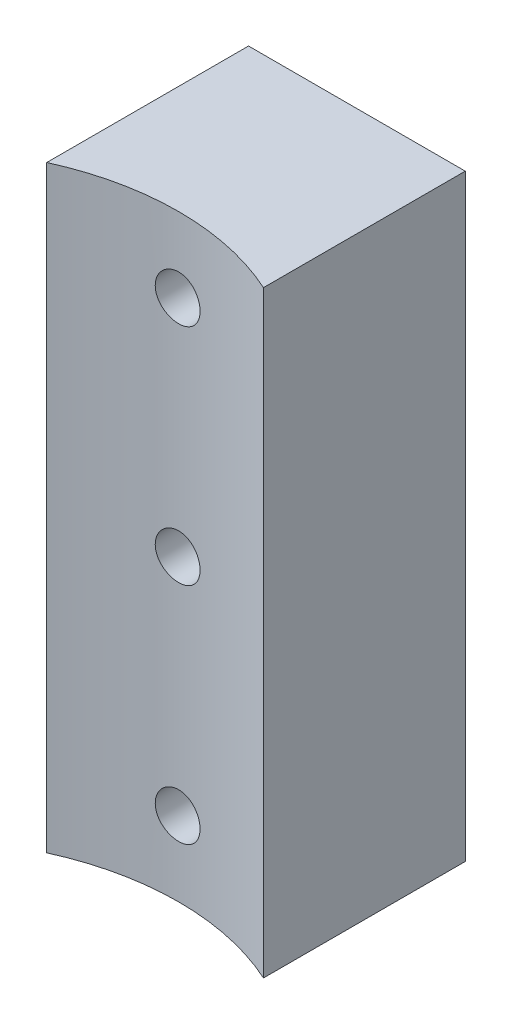
ISO-10303-21;
HEADER;
FILE_DESCRIPTION(('STEP AP214'),'2;1');
FILE_NAME('part.step','',(''),(''),'','','');
FILE_SCHEMA(('AUTOMOTIVE_DESIGN { 1 0 10303 214 1 1 1 1 }'));
ENDSEC;
DATA;
#1=APPLICATION_CONTEXT('core data for automotive mechanical design processes');
#2=APPLICATION_PROTOCOL_DEFINITION('international standard','automotive_design',2000,#1);
#3=PRODUCT_CONTEXT('',#1,'mechanical');
#4=PRODUCT('Part','Part','',(#3));
#5=PRODUCT_RELATED_PRODUCT_CATEGORY('part','',(#4));
#6=PRODUCT_DEFINITION_FORMATION('','',#4);
#7=PRODUCT_DEFINITION_CONTEXT('part definition',#1,'design');
#8=PRODUCT_DEFINITION('design','',#6,#7);
#9=PRODUCT_DEFINITION_SHAPE('','',#8);
#10=(LENGTH_UNIT() NAMED_UNIT(*) SI_UNIT(.MILLI.,.METRE.));
#11=(NAMED_UNIT(*) PLANE_ANGLE_UNIT() SI_UNIT($,.RADIAN.));
#12=(NAMED_UNIT(*) SI_UNIT($,.STERADIAN.) SOLID_ANGLE_UNIT());
#13=UNCERTAINTY_MEASURE_WITH_UNIT(LENGTH_MEASURE(1.E-05),#10,'distance_accuracy_value','');
#14=(GEOMETRIC_REPRESENTATION_CONTEXT(3) GLOBAL_UNCERTAINTY_ASSIGNED_CONTEXT((#13)) GLOBAL_UNIT_ASSIGNED_CONTEXT((#10,
#11,#12)) REPRESENTATION_CONTEXT('',''));
#15=CARTESIAN_POINT('',(0.,0.,0.));
#16=DIRECTION('',(0.,0.,1.));
#17=DIRECTION('',(1.,0.,0.));
#18=AXIS2_PLACEMENT_3D('',#15,#16,#17);
#19=CARTESIAN_POINT('',(0.,80.,45.355140872393));
#20=DIRECTION('',(0.,-1.,0.));
#21=DIRECTION('',(0.,0.,-1.));
#22=AXIS2_PLACEMENT_3D('',#19,#20,#21);
#23=CYLINDRICAL_SURFACE('',#22,35.);
#24=CARTESIAN_POINT('',(-3.,70.,10.4839493240676));
#25=CARTESIAN_POINT('',(-2.99999266095691,70.1681788977969,10.4839476198831));
#26=CARTESIAN_POINT('',(-2.98581034508464,70.3364718555865,10.4827195690312));
#27=CARTESIAN_POINT('',(-2.92944387718635,70.668400071108,10.4779401861653));
#28=CARTESIAN_POINT('',(-2.88722811123404,70.8320298525538,10.4743862312445));
#29=CARTESIAN_POINT('',(-2.77602575299662,71.1497763164806,10.4653605027679));
#30=CARTESIAN_POINT('',(-2.70705447640826,71.3038983830823,10.4598898265767));
#31=CARTESIAN_POINT('',(-2.54432647781201,71.5983417986807,10.4476484327925));
#32=CARTESIAN_POINT('',(-2.45057500494258,71.7386660618111,10.4408779906093));
#33=CARTESIAN_POINT('',(-2.24067380704697,72.0019468210089,10.4267793440726));
#34=CARTESIAN_POINT('',(-2.12447081430969,72.1248607834929,10.4194498388452));
#35=CARTESIAN_POINT('',(-1.87307803845592,72.3494663357357,10.4050708154877));
#36=CARTESIAN_POINT('',(-1.73788742116144,72.4511569926087,10.3980213096763));
#37=CARTESIAN_POINT('',(-1.45210217047512,72.6305716963779,10.3849841664228));
#38=CARTESIAN_POINT('',(-1.30148426539791,72.7082588039076,10.3789981715876));
#39=CARTESIAN_POINT('',(-0.989282152733716,72.8372248736093,10.3687765481909));
#40=CARTESIAN_POINT('',(-0.827698147061475,72.8885043218666,10.3645408874112));
#41=CARTESIAN_POINT('',(-0.498575054218786,72.9630766244092,10.3583062735014));
#42=CARTESIAN_POINT('',(-0.331051705301404,72.9864384709037,10.3563018073094));
#43=CARTESIAN_POINT('',(0.00554951687181451,73.0047257169121,10.3547367392413));
#44=CARTESIAN_POINT('',(0.174627359650706,72.9996516727498,10.3551760895541));
#45=CARTESIAN_POINT('',(0.509070191841324,72.9612675389711,10.3584446077199));
#46=CARTESIAN_POINT('',(0.674443766007422,72.9280316396164,10.3612674962547));
#47=CARTESIAN_POINT('',(0.997256506055928,72.834382628761,10.3689783939812));
#48=CARTESIAN_POINT('',(1.15469559272899,72.7739692460094,10.3738664237847));
#49=CARTESIAN_POINT('',(1.45740602670417,72.627597672851,10.3851685469964));
#50=CARTESIAN_POINT('',(1.6026612561083,72.5416063081392,10.3915846200892));
#51=CARTESIAN_POINT('',(1.87670479976717,72.3465438378033,10.4052219438467));
#52=CARTESIAN_POINT('',(2.0054927602542,72.2374722364782,10.4124432118031));
#53=CARTESIAN_POINT('',(2.24337983249144,71.9989274115879,10.4269069372816));
#54=CARTESIAN_POINT('',(2.35241430046894,71.8693897117684,10.4341493882716));
#55=CARTESIAN_POINT('',(2.54719973764136,71.593814336155,10.4478158774214));
#56=CARTESIAN_POINT('',(2.63295068598783,71.4477766455869,10.4542399148484));
#57=CARTESIAN_POINT('',(2.77873275129372,71.1433008088583,10.4655433191656));
#58=CARTESIAN_POINT('',(2.83876042932541,70.984861008014,10.4704224794993));
#59=CARTESIAN_POINT('',(2.93134369450066,70.660100511375,10.4780796259716));
#60=CARTESIAN_POINT('',(2.96389989316699,70.4937799910943,10.4808576588816));
#61=CARTESIAN_POINT('',(3.00053403997774,70.1585451904919,10.4839903442085));
#62=CARTESIAN_POINT('',(3.00470217287089,69.9896408341738,10.4843526708947));
#63=CARTESIAN_POINT('',(2.98467818807446,69.6535358314843,10.4826331742699));
#64=CARTESIAN_POINT('',(2.96048635048195,69.4863351683029,10.4805513750984));
#65=CARTESIAN_POINT('',(2.88450436177439,69.1586431948189,10.4741851877669));
#66=CARTESIAN_POINT('',(2.8327563709266,68.9981420378853,10.4699041647198));
#67=CARTESIAN_POINT('',(2.70317389532559,68.6880999611053,10.4596246741063));
#68=CARTESIAN_POINT('',(2.62533896819065,68.538559227178,10.4536261774153));
#69=CARTESIAN_POINT('',(2.44556416469073,68.2542704319917,10.440569016248));
#70=CARTESIAN_POINT('',(2.34356423538402,68.1195604686071,10.4335077268092));
#71=CARTESIAN_POINT('',(2.11844147546403,67.8691423551176,10.4191294466342));
#72=CARTESIAN_POINT('',(1.99531826047652,67.7534345508645,10.4118124512469));
#73=CARTESIAN_POINT('',(1.73105402731211,67.5439970271157,10.3977243081168));
#74=CARTESIAN_POINT('',(1.58986645530175,67.450325934563,10.3909546471913));
#75=CARTESIAN_POINT('',(1.29371299875351,67.2880232282786,10.3787453903888));
#76=CARTESIAN_POINT('',(1.13874725876361,67.2193913518968,10.3733057805603));
#77=CARTESIAN_POINT('',(0.819645734517399,67.1092157912916,10.3643763484736));
#78=CARTESIAN_POINT('',(0.65552250479355,67.0676359646391,10.3608839256061));
#79=CARTESIAN_POINT('',(0.322592960793778,67.0126266986178,10.356231794647));
#80=CARTESIAN_POINT('',(0.153786740881582,66.9991966924382,10.3550720395859));
#81=CARTESIAN_POINT('',(-0.183139370810549,67.0008750821372,10.3552158573381));
#82=CARTESIAN_POINT('',(-0.35125972839602,67.0158921579829,10.3565115477539));
#83=CARTESIAN_POINT('',(-0.682581136937826,67.0738478591427,10.3614050914978));
#84=CARTESIAN_POINT('',(-0.845782181536314,67.1167865205418,10.3650029478013));
#85=CARTESIAN_POINT('',(-1.16263730873111,67.2293430218768,10.3740972209368));
#86=CARTESIAN_POINT('',(-1.31629202900732,67.298959077572,10.3795935107952));
#87=CARTESIAN_POINT('',(-1.60974810184892,67.4628838846323,10.3918700486257));
#88=CARTESIAN_POINT('',(-1.74954965509232,67.5571922782303,10.3986502779943));
#89=CARTESIAN_POINT('',(-2.01179846018097,67.7681675615409,10.4127597969763));
#90=CARTESIAN_POINT('',(-2.1341911912239,67.8849021138727,10.4200907062253));
#91=CARTESIAN_POINT('',(-2.35769690654863,68.1372917927201,10.4344615574563));
#92=CARTESIAN_POINT('',(-2.45880473667584,68.2729514887808,10.4415014286323));
#93=CARTESIAN_POINT('',(-2.63701593547982,68.5596186650063,10.4545080517243));
#94=CARTESIAN_POINT('',(-2.71407186567634,68.7106557064792,10.4604726732226));
#95=CARTESIAN_POINT('',(-2.84163046603466,69.0234732227605,10.4706275648487));
#96=CARTESIAN_POINT('',(-2.89216358839389,69.1852411353663,10.4748198687842));
#97=CARTESIAN_POINT('',(-2.95240722581038,69.4566320780792,10.4798800238554));
#98=CARTESIAN_POINT('',(-2.97023070444527,69.564510957119,10.4813989701122));
#99=CARTESIAN_POINT('',(-2.99402945794011,69.781577186907,10.483434172228));
#100=CARTESIAN_POINT('',(-3.00000476685127,69.890764533894,10.4839504309686));
#101=CARTESIAN_POINT('',(-3.,70.,10.4839493240676));
#102=B_SPLINE_CURVE_WITH_KNOTS('',3,(#24,#25,#26,#27,#28,#29,#30,#31,#32,#33,#34,#35,#36,#37,
#38,#39,#40,#41,#42,#43,#44,#45,#46,#47,#48,#49,#50,#51,#52,#53,#54,#55,#56,#57,#58,#59,#60,#61,
#62,#63,#64,#65,#66,#67,#68,#69,#70,#71,#72,#73,#74,#75,#76,#77,#78,#79,#80,#81,#82,#83,#84,#85,
#86,#87,#88,#89,#90,#91,#92,#93,#94,#95,#96,#97,#98,#99,#100,#101),.UNSPECIFIED.,.T.,.F.,(4,2,2,
2,2,2,2,2,2,2,2,2,2,2,2,2,2,2,2,2,2,2,2,2,2,2,2,2,2,2,2,2,2,2,2,2,2,2,4),(0.,0.5041378451549,
1.00884518512539,1.51326404003696,2.01757613044268,2.52309976273194,3.02864561100068,
3.53496561920688,4.04127630725862,4.54633315507158,5.0513801219166,5.55510070289603,
6.05882631148133,6.56320811562687,7.06760075362891,7.57361533214636,8.07963036375613,
8.58571302310646,9.09178441661878,9.59624734203882,10.1007052851759,10.6043936277359,
11.1080905122643,11.6130525231886,12.1180237237333,12.6243235404852,13.1306180462274,
13.6362347291713,14.1418412311696,14.6458273992463,15.1498142186598,15.6537673362459,
16.1577131524622,16.6632040203355,17.1688171527569,17.6754213142688,18.1814425380561,
18.5088908177618,18.836338156391),.UNSPECIFIED.);
#103=CARTESIAN_POINT('',(-3.,70.,10.4839493240676));
#104=VERTEX_POINT('',#103);
#105=EDGE_CURVE('E100',#104,#104,#102,.T.);
#106=ORIENTED_EDGE('',*,*,#105,.T.);
#107=EDGE_LOOP('',(#106));
#108=FACE_BOUND('',#107,.T.);
#109=CARTESIAN_POINT('',(-3.,40.,10.4839493240676));
#110=CARTESIAN_POINT('',(-2.99999266095691,40.1681788977969,10.4839476198831));
#111=CARTESIAN_POINT('',(-2.98581034508464,40.3364718555865,10.4827195690312));
#112=CARTESIAN_POINT('',(-2.92944387718635,40.668400071108,10.4779401861653));
#113=CARTESIAN_POINT('',(-2.88722811123404,40.8320298525538,10.4743862312445));
#114=CARTESIAN_POINT('',(-2.77602575299661,41.1497763164806,10.4653605027679));
#115=CARTESIAN_POINT('',(-2.70705447640826,41.3038983830823,10.4598898265767));
#116=CARTESIAN_POINT('',(-2.54432647781201,41.5983417986807,10.4476484327925));
#117=CARTESIAN_POINT('',(-2.45057500494258,41.7386660618111,10.4408779906093));
#118=CARTESIAN_POINT('',(-2.24067380704696,42.0019468210089,10.4267793440726));
#119=CARTESIAN_POINT('',(-2.12447081430967,42.1248607834929,10.4194498388452));
#120=CARTESIAN_POINT('',(-1.87307803845591,42.3494663357357,10.4050708154877));
#121=CARTESIAN_POINT('',(-1.73788742116142,42.4511569926087,10.3980213096763));
#122=CARTESIAN_POINT('',(-1.45210217047511,42.6305716963779,10.3849841664228));
#123=CARTESIAN_POINT('',(-1.3014842653979,42.7082588039076,10.3789981715876));
#124=CARTESIAN_POINT('',(-0.989282152733707,42.8372248736093,10.3687765481909));
#125=CARTESIAN_POINT('',(-0.827698147061466,42.8885043218666,10.3645408874112));
#126=CARTESIAN_POINT('',(-0.498575054218778,42.9630766244091,10.3583062735014));
#127=CARTESIAN_POINT('',(-0.331051705301396,42.9864384709037,10.3563018073094));
#128=CARTESIAN_POINT('',(0.00554951687182248,43.0047257169121,10.3547367392413));
#129=CARTESIAN_POINT('',(0.174627359650714,42.9996516727498,10.3551760895541));
#130=CARTESIAN_POINT('',(0.509070191841332,42.9612675389711,10.3584446077199));
#131=CARTESIAN_POINT('',(0.674443766007428,42.9280316396164,10.3612674962547));
#132=CARTESIAN_POINT('',(0.997256506055934,42.834382628761,10.3689783939812));
#133=CARTESIAN_POINT('',(1.154695592729,42.7739692460094,10.3738664237847));
#134=CARTESIAN_POINT('',(1.45740602670418,42.627597672851,10.3851685469964));
#135=CARTESIAN_POINT('',(1.6026612561083,42.5416063081392,10.3915846200892));
#136=CARTESIAN_POINT('',(1.87670479976717,42.3465438378033,10.4052219438467));
#137=CARTESIAN_POINT('',(2.0054927602542,42.2374722364782,10.4124432118031));
#138=CARTESIAN_POINT('',(2.24337983249145,41.9989274115879,10.4269069372816));
#139=CARTESIAN_POINT('',(2.35241430046895,41.8693897117684,10.4341493882716));
#140=CARTESIAN_POINT('',(2.54719973764136,41.593814336155,10.4478158774214));
#141=CARTESIAN_POINT('',(2.63295068598784,41.4477766455869,10.4542399148484));
#142=CARTESIAN_POINT('',(2.77873275129373,41.1433008088582,10.4655433191656));
#143=CARTESIAN_POINT('',(2.83876042932541,40.9848610080139,10.4704224794993));
#144=CARTESIAN_POINT('',(2.93134369450066,40.6601005113749,10.4780796259716));
#145=CARTESIAN_POINT('',(2.963899893167,40.4937799910943,10.4808576588816));
#146=CARTESIAN_POINT('',(3.00053403997774,40.1585451904919,10.4839903442085));
#147=CARTESIAN_POINT('',(3.00470217287089,39.9896408341738,10.4843526708947));
#148=CARTESIAN_POINT('',(2.98467818807446,39.6535358314843,10.4826331742699));
#149=CARTESIAN_POINT('',(2.96048635048195,39.4863351683029,10.4805513750984));
#150=CARTESIAN_POINT('',(2.88450436177439,39.1586431948189,10.4741851877669));
#151=CARTESIAN_POINT('',(2.8327563709266,38.9981420378853,10.4699041647198));
#152=CARTESIAN_POINT('',(2.70317389532559,38.6880999611053,10.4596246741063));
#153=CARTESIAN_POINT('',(2.62533896819065,38.538559227178,10.4536261774153));
#154=CARTESIAN_POINT('',(2.44556416469073,38.2542704319917,10.440569016248));
#155=CARTESIAN_POINT('',(2.34356423538402,38.1195604686071,10.4335077268092));
#156=CARTESIAN_POINT('',(2.11844147546403,37.8691423551176,10.4191294466342));
#157=CARTESIAN_POINT('',(1.99531826047652,37.7534345508645,10.4118124512469));
#158=CARTESIAN_POINT('',(1.7310540273121,37.5439970271157,10.3977243081168));
#159=CARTESIAN_POINT('',(1.58986645530174,37.450325934563,10.3909546471913));
#160=CARTESIAN_POINT('',(1.2937129987535,37.2880232282786,10.3787453903888));
#161=CARTESIAN_POINT('',(1.13874725876359,37.2193913518968,10.3733057805603));
#162=CARTESIAN_POINT('',(0.819645734517386,37.1092157912916,10.3643763484736));
#163=CARTESIAN_POINT('',(0.655522504793538,37.067635964639,10.3608839256061));
#164=CARTESIAN_POINT('',(0.322592960793767,37.0126266986178,10.356231794647));
#165=CARTESIAN_POINT('',(0.153786740881569,36.9991966924382,10.3550720395859));
#166=CARTESIAN_POINT('',(-0.183139370810562,37.0008750821372,10.3552158573381));
#167=CARTESIAN_POINT('',(-0.351259728396031,37.0158921579829,10.3565115477539));
#168=CARTESIAN_POINT('',(-0.682581136937835,37.0738478591427,10.3614050914978));
#169=CARTESIAN_POINT('',(-0.845782181536322,37.1167865205418,10.3650029478012));
#170=CARTESIAN_POINT('',(-1.16263730873112,37.2293430218768,10.3740972209368));
#171=CARTESIAN_POINT('',(-1.31629202900733,37.298959077572,10.3795935107952));
#172=CARTESIAN_POINT('',(-1.60974810184893,37.4628838846323,10.3918700486257));
#173=CARTESIAN_POINT('',(-1.74954965509232,37.5571922782303,10.3986502779943));
#174=CARTESIAN_POINT('',(-2.01179846018098,37.7681675615409,10.4127597969763));
#175=CARTESIAN_POINT('',(-2.13419119122391,37.8849021138727,10.4200907062253));
#176=CARTESIAN_POINT('',(-2.35769690654864,38.1372917927201,10.4344615574563));
#177=CARTESIAN_POINT('',(-2.45880473667584,38.2729514887808,10.4415014286323));
#178=CARTESIAN_POINT('',(-2.63701593547982,38.5596186650063,10.4545080517243));
#179=CARTESIAN_POINT('',(-2.71407186567635,38.7106557064792,10.4604726732226));
#180=CARTESIAN_POINT('',(-2.84163046603466,39.0234732227605,10.4706275648487));
#181=CARTESIAN_POINT('',(-2.89216358839389,39.1852411353663,10.4748198687842));
#182=CARTESIAN_POINT('',(-2.95240722581038,39.4566320780792,10.4798800238554));
#183=CARTESIAN_POINT('',(-2.97023070444527,39.5645109571189,10.4813989701123));
#184=CARTESIAN_POINT('',(-2.9940294579401,39.781577186907,10.483434172228));
#185=CARTESIAN_POINT('',(-3.00000476685127,39.890764533894,10.4839504309686));
#186=CARTESIAN_POINT('',(-3.,40.,10.4839493240676));
#187=B_SPLINE_CURVE_WITH_KNOTS('',3,(#109,#110,#111,#112,#113,#114,#115,#116,#117,#118,#119,
#120,#121,#122,#123,#124,#125,#126,#127,#128,#129,#130,#131,#132,#133,#134,#135,#136,#137,#138,
#139,#140,#141,#142,#143,#144,#145,#146,#147,#148,#149,#150,#151,#152,#153,#154,#155,#156,#157,
#158,#159,#160,#161,#162,#163,#164,#165,#166,#167,#168,#169,#170,#171,#172,#173,#174,#175,#176,
#177,#178,#179,#180,#181,#182,#183,#184,#185,#186),.UNSPECIFIED.,.T.,.F.,(4,2,2,2,2,2,2,2,2,2,2,
2,2,2,2,2,2,2,2,2,2,2,2,2,2,2,2,2,2,2,2,2,2,2,2,2,2,2,4),(0.,0.504137845154907,1.0088451851254,
1.51326404003697,2.01757613044269,2.52309976273197,3.0286456110007,3.53496561920689,
4.04127630725863,4.54633315507159,5.0513801219166,5.55510070289604,6.05882631148134,
6.56320811562686,7.06760075362891,7.57361533214636,8.07963036375613,8.58571302310648,
9.09178441661878,9.59624734203881,10.1007052851759,10.6043936277359,11.1080905122643,
11.6130525231886,12.1180237237333,12.6243235404852,13.1306180462274,13.6362347291713,
14.1418412311696,14.6458273992463,15.1498142186598,15.6537673362459,16.1577131524622,
16.6632040203355,17.1688171527569,17.6754213142688,18.1814425380561,18.5088908177617,
18.836338156391),.UNSPECIFIED.);
#188=CARTESIAN_POINT('',(-3.,40.,10.4839493240676));
#189=VERTEX_POINT('',#188);
#190=EDGE_CURVE('E117',#189,#189,#187,.T.);
#191=ORIENTED_EDGE('',*,*,#190,.T.);
#192=EDGE_LOOP('',(#191));
#193=FACE_BOUND('',#192,.T.);
#194=CARTESIAN_POINT('',(-3.,10.,10.4839493240676));
#195=CARTESIAN_POINT('',(-2.99999266095691,10.1681788977969,10.4839476198831));
#196=CARTESIAN_POINT('',(-2.98581034508464,10.3364718555865,10.4827195690312));
#197=CARTESIAN_POINT('',(-2.92944387718635,10.668400071108,10.4779401861653));
#198=CARTESIAN_POINT('',(-2.88722811123404,10.8320298525538,10.4743862312445));
#199=CARTESIAN_POINT('',(-2.77602575299661,11.1497763164806,10.4653605027679));
#200=CARTESIAN_POINT('',(-2.70705447640826,11.3038983830823,10.4598898265767));
#201=CARTESIAN_POINT('',(-2.54432647781201,11.5983417986807,10.4476484327925));
#202=CARTESIAN_POINT('',(-2.45057500494258,11.7386660618111,10.4408779906093));
#203=CARTESIAN_POINT('',(-2.24067380704696,12.0019468210089,10.4267793440726));
#204=CARTESIAN_POINT('',(-2.12447081430967,12.1248607834929,10.4194498388452));
#205=CARTESIAN_POINT('',(-1.87307803845591,12.3494663357358,10.4050708154877));
#206=CARTESIAN_POINT('',(-1.73788742116142,12.4511569926087,10.3980213096763));
#207=CARTESIAN_POINT('',(-1.45210217047511,12.6305716963779,10.3849841664228));
#208=CARTESIAN_POINT('',(-1.3014842653979,12.7082588039076,10.3789981715876));
#209=CARTESIAN_POINT('',(-0.989282152733704,12.8372248736093,10.3687765481909));
#210=CARTESIAN_POINT('',(-0.827698147061464,12.8885043218666,10.3645408874112));
#211=CARTESIAN_POINT('',(-0.498575054218777,12.9630766244092,10.3583062735014));
#212=CARTESIAN_POINT('',(-0.331051705301395,12.9864384709037,10.3563018073094));
#213=CARTESIAN_POINT('',(0.0055495168718231,13.0047257169121,10.3547367392413));
#214=CARTESIAN_POINT('',(0.174627359650714,12.9996516727498,10.3551760895541));
#215=CARTESIAN_POINT('',(0.509070191841332,12.9612675389711,10.3584446077199));
#216=CARTESIAN_POINT('',(0.674443766007428,12.9280316396164,10.3612674962547));
#217=CARTESIAN_POINT('',(0.997256506055934,12.834382628761,10.3689783939812));
#218=CARTESIAN_POINT('',(1.154695592729,12.7739692460094,10.3738664237847));
#219=CARTESIAN_POINT('',(1.45740602670418,12.627597672851,10.3851685469964));
#220=CARTESIAN_POINT('',(1.6026612561083,12.5416063081392,10.3915846200892));
#221=CARTESIAN_POINT('',(1.87670479976717,12.3465438378033,10.4052219438467));
#222=CARTESIAN_POINT('',(2.0054927602542,12.2374722364782,10.4124432118031));
#223=CARTESIAN_POINT('',(2.24337983249145,11.9989274115879,10.4269069372816));
#224=CARTESIAN_POINT('',(2.35241430046895,11.8693897117684,10.4341493882716));
#225=CARTESIAN_POINT('',(2.54719973764137,11.593814336155,10.4478158774214));
#226=CARTESIAN_POINT('',(2.63295068598784,11.4477766455869,10.4542399148484));
#227=CARTESIAN_POINT('',(2.77873275129373,11.1433008088582,10.4655433191656));
#228=CARTESIAN_POINT('',(2.83876042932541,10.9848610080139,10.4704224794993));
#229=CARTESIAN_POINT('',(2.93134369450066,10.6601005113749,10.4780796259716));
#230=CARTESIAN_POINT('',(2.963899893167,10.4937799910943,10.4808576588816));
#231=CARTESIAN_POINT('',(3.00053403997774,10.1585451904919,10.4839903442085));
#232=CARTESIAN_POINT('',(3.00470217287089,9.98964083417379,10.4843526708947));
#233=CARTESIAN_POINT('',(2.98467818807446,9.65353583148434,10.4826331742699));
#234=CARTESIAN_POINT('',(2.96048635048195,9.48633516830293,10.4805513750984));
#235=CARTESIAN_POINT('',(2.88450436177439,9.15864319481893,10.4741851877669));
#236=CARTESIAN_POINT('',(2.8327563709266,8.99814203788532,10.4699041647198));
#237=CARTESIAN_POINT('',(2.70317389532559,8.68809996110534,10.4596246741063));
#238=CARTESIAN_POINT('',(2.62533896819065,8.538559227178,10.4536261774153));
#239=CARTESIAN_POINT('',(2.44556416469073,8.25427043199173,10.440569016248));
#240=CARTESIAN_POINT('',(2.34356423538402,8.11956046860708,10.4335077268092));
#241=CARTESIAN_POINT('',(2.11844147546403,7.8691423551176,10.4191294466342));
#242=CARTESIAN_POINT('',(1.99531826047651,7.7534345508645,10.4118124512469));
#243=CARTESIAN_POINT('',(1.7310540273121,7.54399702711568,10.3977243081168));
#244=CARTESIAN_POINT('',(1.58986645530174,7.45032593456302,10.3909546471913));
#245=CARTESIAN_POINT('',(1.2937129987535,7.28802322827864,10.3787453903888));
#246=CARTESIAN_POINT('',(1.1387472587636,7.21939135189683,10.3733057805603));
#247=CARTESIAN_POINT('',(0.819645734517389,7.10921579129159,10.3643763484736));
#248=CARTESIAN_POINT('',(0.655522504793541,7.06763596463904,10.3608839256061));
#249=CARTESIAN_POINT('',(0.322592960793769,7.01262669861777,10.356231794647));
#250=CARTESIAN_POINT('',(0.153786740881572,6.99919669243817,10.3550720395859));
#251=CARTESIAN_POINT('',(-0.18313937081056,7.0008750821372,10.3552158573381));
#252=CARTESIAN_POINT('',(-0.35125972839603,7.01589215798287,10.3565115477539));
#253=CARTESIAN_POINT('',(-0.682581136937835,7.07384785914267,10.3614050914978));
#254=CARTESIAN_POINT('',(-0.845782181536321,7.11678652054176,10.3650029478012));
#255=CARTESIAN_POINT('',(-1.16263730873111,7.2293430218768,10.3740972209368));
#256=CARTESIAN_POINT('',(-1.31629202900733,7.29895907757196,10.3795935107952));
#257=CARTESIAN_POINT('',(-1.60974810184893,7.46288388463228,10.3918700486257));
#258=CARTESIAN_POINT('',(-1.74954965509232,7.55719227823028,10.3986502779943));
#259=CARTESIAN_POINT('',(-2.01179846018098,7.76816756154087,10.4127597969763));
#260=CARTESIAN_POINT('',(-2.13419119122391,7.88490211387266,10.4200907062253));
#261=CARTESIAN_POINT('',(-2.35769690654864,8.13729179272008,10.4344615574563));
#262=CARTESIAN_POINT('',(-2.45880473667584,8.27295148878081,10.4415014286323));
#263=CARTESIAN_POINT('',(-2.63701593547982,8.55961866500635,10.4545080517243));
#264=CARTESIAN_POINT('',(-2.71407186567635,8.71065570647919,10.4604726732226));
#265=CARTESIAN_POINT('',(-2.84163046603466,9.0234732227605,10.4706275648487));
#266=CARTESIAN_POINT('',(-2.89216358839389,9.1852411353663,10.4748198687842));
#267=CARTESIAN_POINT('',(-2.95240722581038,9.45663207807922,10.4798800238554));
#268=CARTESIAN_POINT('',(-2.97023070444527,9.56451095711896,10.4813989701122));
#269=CARTESIAN_POINT('',(-2.9940294579401,9.78157718690703,10.483434172228));
#270=CARTESIAN_POINT('',(-3.00000476685127,9.89076453389398,10.4839504309686));
#271=CARTESIAN_POINT('',(-3.,10.,10.4839493240676));
#272=B_SPLINE_CURVE_WITH_KNOTS('',3,(#194,#195,#196,#197,#198,#199,#200,#201,#202,#203,#204,
#205,#206,#207,#208,#209,#210,#211,#212,#213,#214,#215,#216,#217,#218,#219,#220,#221,#222,#223,
#224,#225,#226,#227,#228,#229,#230,#231,#232,#233,#234,#235,#236,#237,#238,#239,#240,#241,#242,
#243,#244,#245,#246,#247,#248,#249,#250,#251,#252,#253,#254,#255,#256,#257,#258,#259,#260,#261,
#262,#263,#264,#265,#266,#267,#268,#269,#270,#271),.UNSPECIFIED.,.T.,.F.,(4,2,2,2,2,2,2,2,2,2,2,
2,2,2,2,2,2,2,2,2,2,2,2,2,2,2,2,2,2,2,2,2,2,2,2,2,2,2,4),(0.,0.504137845154905,1.0088451851254,
1.51326404003696,2.01757613044269,2.52309976273197,3.0286456110007,3.53496561920689,
4.04127630725863,4.54633315507159,5.0513801219166,5.55510070289604,6.05882631148134,
6.56320811562686,7.06760075362891,7.57361533214636,8.07963036375614,8.58571302310648,
9.09178441661877,9.5962473420388,10.1007052851759,10.6043936277359,11.1080905122643,
11.6130525231886,12.1180237237333,12.6243235404852,13.1306180462274,13.6362347291713,
14.1418412311696,14.6458273992463,15.1498142186598,15.6537673362459,16.1577131524622,
16.6632040203355,17.1688171527569,17.6754213142688,18.1814425380561,18.5088908177617,
18.836338156391),.UNSPECIFIED.);
#273=CARTESIAN_POINT('',(-3.,10.,10.4839493240676));
#274=VERTEX_POINT('',#273);
#275=EDGE_CURVE('E138',#274,#274,#272,.T.);
#276=ORIENTED_EDGE('',*,*,#275,.T.);
#277=EDGE_LOOP('',(#276));
#278=FACE_BOUND('',#277,.T.);
#279=CARTESIAN_POINT('',(0.,0.,45.355140872393));
#280=DIRECTION('',(0.,-1.,0.));
#281=DIRECTION('',(0.,0.,-1.));
#282=AXIS2_PLACEMENT_3D('',#279,#280,#281);
#283=CIRCLE('',#282,35.);
#284=CARTESIAN_POINT('',(-14.5,0.,13.5));
#285=VERTEX_POINT('',#284);
#286=CARTESIAN_POINT('',(14.5,0.,13.5));
#287=VERTEX_POINT('',#286);
#288=EDGE_CURVE('E97',#285,#287,#283,.T.);
#289=ORIENTED_EDGE('',*,*,#288,.T.);
#290=DIRECTION('',(0.,-1.,0.));
#291=VECTOR('',#290,1.);
#292=CARTESIAN_POINT('',(14.5,80.,13.5));
#293=LINE('',#292,#291);
#294=CARTESIAN_POINT('',(14.5,80.,13.5));
#295=VERTEX_POINT('',#294);
#296=EDGE_CURVE('E11',#295,#287,#293,.T.);
#297=ORIENTED_EDGE('',*,*,#296,.F.);
#298=CARTESIAN_POINT('',(0.,80.,45.355140872393));
#299=DIRECTION('',(0.,-1.,0.));
#300=DIRECTION('',(0.,0.,-1.));
#301=AXIS2_PLACEMENT_3D('',#298,#299,#300);
#302=CIRCLE('',#301,35.);
#303=CARTESIAN_POINT('',(-14.5,80.,13.5));
#304=VERTEX_POINT('',#303);
#305=EDGE_CURVE('E85',#304,#295,#302,.T.);
#306=ORIENTED_EDGE('',*,*,#305,.F.);
#307=DIRECTION('',(0.,-1.,0.));
#308=VECTOR('',#307,1.);
#309=CARTESIAN_POINT('',(-14.5,80.,13.5));
#310=LINE('',#309,#308);
#311=EDGE_CURVE('E93',#304,#285,#310,.T.);
#312=ORIENTED_EDGE('',*,*,#311,.T.);
#313=EDGE_LOOP('',(#289,#297,#306,#312));
#314=FACE_BOUND('',#313,.T.);
#315=ADVANCED_FACE('F33',(#108,#193,#278,#314),#23,.F.);
#316=CARTESIAN_POINT('',(14.5,80.,-13.5));
#317=DIRECTION('',(-1.,0.,0.));
#318=DIRECTION('',(0.,0.,1.));
#319=AXIS2_PLACEMENT_3D('',#316,#317,#318);
#320=PLANE('',#319);
#321=DIRECTION('',(0.,0.,-1.));
#322=VECTOR('',#321,1.);
#323=CARTESIAN_POINT('',(14.5,0.,-13.5));
#324=LINE('',#323,#322);
#325=CARTESIAN_POINT('',(14.5,0.,-13.5));
#326=VERTEX_POINT('',#325);
#327=EDGE_CURVE('E89',#287,#326,#324,.T.);
#328=ORIENTED_EDGE('',*,*,#327,.T.);
#329=DIRECTION('',(0.,-1.,0.));
#330=VECTOR('',#329,1.);
#331=CARTESIAN_POINT('',(14.5,80.,-13.5));
#332=LINE('',#331,#330);
#333=CARTESIAN_POINT('',(14.5,80.,-13.5));
#334=VERTEX_POINT('',#333);
#335=EDGE_CURVE('E42',#334,#326,#332,.T.);
#336=ORIENTED_EDGE('',*,*,#335,.F.);
#337=DIRECTION('',(0.,0.,-1.));
#338=VECTOR('',#337,1.);
#339=CARTESIAN_POINT('',(14.5,80.,-13.5));
#340=LINE('',#339,#338);
#341=EDGE_CURVE('E80',#295,#334,#340,.T.);
#342=ORIENTED_EDGE('',*,*,#341,.F.);
#343=ORIENTED_EDGE('',*,*,#296,.T.);
#344=EDGE_LOOP('',(#328,#336,#342,#343));
#345=FACE_BOUND('',#344,.T.);
#346=ADVANCED_FACE('F88',(#345),#320,.F.);
#347=CARTESIAN_POINT('',(-14.5,80.,-13.5));
#348=DIRECTION('',(0.,0.,1.));
#349=DIRECTION('',(1.,0.,0.));
#350=AXIS2_PLACEMENT_3D('',#347,#348,#349);
#351=PLANE('',#350);
#352=CARTESIAN_POINT('',(0.,70.,-13.5));
#353=DIRECTION('',(0.,0.,-1.));
#354=DIRECTION('',(-1.,0.,0.));
#355=AXIS2_PLACEMENT_3D('',#352,#353,#354);
#356=CIRCLE('',#355,3.);
#357=CARTESIAN_POINT('',(-3.,70.,-13.5));
#358=VERTEX_POINT('',#357);
#359=EDGE_CURVE('E144',#358,#358,#356,.T.);
#360=ORIENTED_EDGE('',*,*,#359,.F.);
#361=EDGE_LOOP('',(#360));
#362=FACE_BOUND('',#361,.T.);
#363=CARTESIAN_POINT('',(0.,40.,-13.5));
#364=DIRECTION('',(0.,0.,-1.));
#365=DIRECTION('',(-1.,0.,0.));
#366=AXIS2_PLACEMENT_3D('',#363,#364,#365);
#367=CIRCLE('',#366,3.);
#368=CARTESIAN_POINT('',(-3.,40.,-13.5));
#369=VERTEX_POINT('',#368);
#370=EDGE_CURVE('E148',#369,#369,#367,.T.);
#371=ORIENTED_EDGE('',*,*,#370,.F.);
#372=EDGE_LOOP('',(#371));
#373=FACE_BOUND('',#372,.T.);
#374=CARTESIAN_POINT('',(0.,10.,-13.5));
#375=DIRECTION('',(0.,0.,-1.));
#376=DIRECTION('',(-1.,0.,0.));
#377=AXIS2_PLACEMENT_3D('',#374,#375,#376);
#378=CIRCLE('',#377,3.);
#379=CARTESIAN_POINT('',(-3.,10.,-13.5));
#380=VERTEX_POINT('',#379);
#381=EDGE_CURVE('E145',#380,#380,#378,.T.);
#382=ORIENTED_EDGE('',*,*,#381,.F.);
#383=EDGE_LOOP('',(#382));
#384=FACE_BOUND('',#383,.T.);
#385=DIRECTION('',(-1.,0.,0.));
#386=VECTOR('',#385,1.);
#387=CARTESIAN_POINT('',(-14.5,0.,-13.5));
#388=LINE('',#387,#386);
#389=CARTESIAN_POINT('',(-14.5,0.,-13.5));
#390=VERTEX_POINT('',#389);
#391=EDGE_CURVE('E67',#326,#390,#388,.T.);
#392=ORIENTED_EDGE('',*,*,#391,.T.);
#393=DIRECTION('',(0.,-1.,0.));
#394=VECTOR('',#393,1.);
#395=CARTESIAN_POINT('',(-14.5,80.,-13.5));
#396=LINE('',#395,#394);
#397=CARTESIAN_POINT('',(-14.5,80.,-13.5));
#398=VERTEX_POINT('',#397);
#399=EDGE_CURVE('E90',#398,#390,#396,.T.);
#400=ORIENTED_EDGE('',*,*,#399,.F.);
#401=DIRECTION('',(-1.,0.,0.));
#402=VECTOR('',#401,1.);
#403=CARTESIAN_POINT('',(-14.5,80.,-13.5));
#404=LINE('',#403,#402);
#405=EDGE_CURVE('E83',#334,#398,#404,.T.);
#406=ORIENTED_EDGE('',*,*,#405,.F.);
#407=ORIENTED_EDGE('',*,*,#335,.T.);
#408=EDGE_LOOP('',(#392,#400,#406,#407));
#409=FACE_BOUND('',#408,.T.);
#410=ADVANCED_FACE('F91',(#362,#373,#384,#409),#351,.F.);
#411=CARTESIAN_POINT('',(-14.5,80.,-13.5));
#412=DIRECTION('',(1.,0.,0.));
#413=DIRECTION('',(0.,0.,-1.));
#414=AXIS2_PLACEMENT_3D('',#411,#412,#413);
#415=PLANE('',#414);
#416=DIRECTION('',(0.,0.,1.));
#417=VECTOR('',#416,1.);
#418=CARTESIAN_POINT('',(-14.5,0.,-13.5));
#419=LINE('',#418,#417);
#420=EDGE_CURVE('E73',#390,#285,#419,.T.);
#421=ORIENTED_EDGE('',*,*,#420,.T.);
#422=ORIENTED_EDGE('',*,*,#311,.F.);
#423=DIRECTION('',(0.,0.,1.));
#424=VECTOR('',#423,1.);
#425=CARTESIAN_POINT('',(-14.5,80.,-13.5));
#426=LINE('',#425,#424);
#427=EDGE_CURVE('E50',#398,#304,#426,.T.);
#428=ORIENTED_EDGE('',*,*,#427,.F.);
#429=ORIENTED_EDGE('',*,*,#399,.T.);
#430=EDGE_LOOP('',(#421,#422,#428,#429));
#431=FACE_BOUND('',#430,.T.);
#432=ADVANCED_FACE('F105',(#431),#415,.F.);
#433=CARTESIAN_POINT('',(0.,80.,45.355140872393));
#434=DIRECTION('',(0.,-1.,0.));
#435=DIRECTION('',(0.,0.,-1.));
#436=AXIS2_PLACEMENT_3D('',#433,#434,#435);
#437=PLANE('',#436);
#438=ORIENTED_EDGE('',*,*,#305,.T.);
#439=ORIENTED_EDGE('',*,*,#341,.T.);
#440=ORIENTED_EDGE('',*,*,#405,.T.);
#441=ORIENTED_EDGE('',*,*,#427,.T.);
#442=EDGE_LOOP('',(#438,#439,#440,#441));
#443=FACE_BOUND('',#442,.T.);
#444=ADVANCED_FACE('F81',(#443),#437,.F.);
#445=CARTESIAN_POINT('',(0.,0.,45.355140872393));
#446=DIRECTION('',(0.,-1.,0.));
#447=DIRECTION('',(0.,0.,-1.));
#448=AXIS2_PLACEMENT_3D('',#445,#446,#447);
#449=PLANE('',#448);
#450=ORIENTED_EDGE('',*,*,#288,.F.);
#451=ORIENTED_EDGE('',*,*,#420,.F.);
#452=ORIENTED_EDGE('',*,*,#391,.F.);
#453=ORIENTED_EDGE('',*,*,#327,.F.);
#454=EDGE_LOOP('',(#450,#451,#452,#453));
#455=FACE_BOUND('',#454,.T.);
#456=ADVANCED_FACE('F108',(#455),#449,.T.);
#457=CARTESIAN_POINT('',(0.,10.,13.5));
#458=DIRECTION('',(0.,0.,-1.));
#459=DIRECTION('',(-1.,0.,0.));
#460=AXIS2_PLACEMENT_3D('',#457,#458,#459);
#461=CYLINDRICAL_SURFACE('',#460,3.);
#462=ORIENTED_EDGE('',*,*,#381,.T.);
#463=EDGE_LOOP('',(#462));
#464=FACE_BOUND('',#463,.T.);
#465=ORIENTED_EDGE('',*,*,#275,.F.);
#466=EDGE_LOOP('',(#465));
#467=FACE_BOUND('',#466,.T.);
#468=ADVANCED_FACE('F131',(#464,#467),#461,.F.);
#469=CARTESIAN_POINT('',(0.,40.,13.5));
#470=DIRECTION('',(0.,0.,-1.));
#471=DIRECTION('',(-1.,0.,0.));
#472=AXIS2_PLACEMENT_3D('',#469,#470,#471);
#473=CYLINDRICAL_SURFACE('',#472,3.);
#474=ORIENTED_EDGE('',*,*,#370,.T.);
#475=EDGE_LOOP('',(#474));
#476=FACE_BOUND('',#475,.T.);
#477=ORIENTED_EDGE('',*,*,#190,.F.);
#478=EDGE_LOOP('',(#477));
#479=FACE_BOUND('',#478,.T.);
#480=ADVANCED_FACE('F126',(#476,#479),#473,.F.);
#481=CARTESIAN_POINT('',(0.,70.,13.5));
#482=DIRECTION('',(0.,0.,-1.));
#483=DIRECTION('',(-1.,0.,0.));
#484=AXIS2_PLACEMENT_3D('',#481,#482,#483);
#485=CYLINDRICAL_SURFACE('',#484,3.);
#486=ORIENTED_EDGE('',*,*,#359,.T.);
#487=EDGE_LOOP('',(#486));
#488=FACE_BOUND('',#487,.T.);
#489=ORIENTED_EDGE('',*,*,#105,.F.);
#490=EDGE_LOOP('',(#489));
#491=FACE_BOUND('',#490,.T.);
#492=ADVANCED_FACE('F123',(#488,#491),#485,.F.);
#493=CLOSED_SHELL('',(#315,#346,#410,#432,#444,#456,#468,#480,#492));
#494=MANIFOLD_SOLID_BREP('B2',#493);
#495=ADVANCED_BREP_SHAPE_REPRESENTATION('',(#18,#494),#14);
#496=SHAPE_DEFINITION_REPRESENTATION(#9,#495);
ENDSEC;
END-ISO-10303-21;
